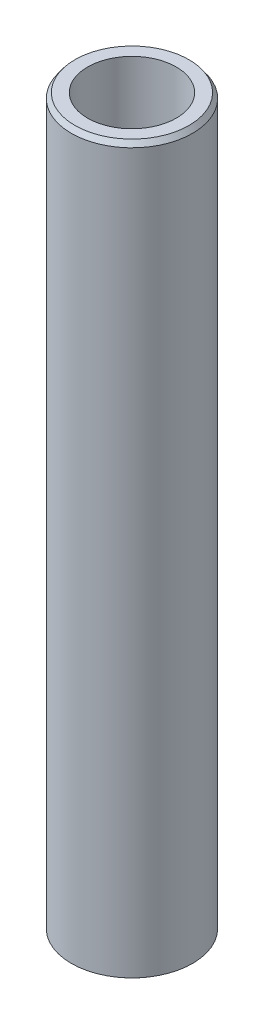
ISO-10303-21;
HEADER;
FILE_DESCRIPTION(('STEP AP214'),'2;1');
FILE_NAME('part.step','',(''),(''),'','','');
FILE_SCHEMA(('AUTOMOTIVE_DESIGN { 1 0 10303 214 1 1 1 1 }'));
ENDSEC;
DATA;
#1=APPLICATION_CONTEXT('core data for automotive mechanical design processes');
#2=APPLICATION_PROTOCOL_DEFINITION('international standard','automotive_design',2000,#1);
#3=PRODUCT_CONTEXT('',#1,'mechanical');
#4=PRODUCT('Part','Part','',(#3));
#5=PRODUCT_RELATED_PRODUCT_CATEGORY('part','',(#4));
#6=PRODUCT_DEFINITION_FORMATION('','',#4);
#7=PRODUCT_DEFINITION_CONTEXT('part definition',#1,'design');
#8=PRODUCT_DEFINITION('design','',#6,#7);
#9=PRODUCT_DEFINITION_SHAPE('','',#8);
#10=(LENGTH_UNIT() NAMED_UNIT(*) SI_UNIT(.MILLI.,.METRE.));
#11=(NAMED_UNIT(*) PLANE_ANGLE_UNIT() SI_UNIT($,.RADIAN.));
#12=(NAMED_UNIT(*) SI_UNIT($,.STERADIAN.) SOLID_ANGLE_UNIT());
#13=UNCERTAINTY_MEASURE_WITH_UNIT(LENGTH_MEASURE(1.E-05),#10,'distance_accuracy_value','');
#14=(GEOMETRIC_REPRESENTATION_CONTEXT(3) GLOBAL_UNCERTAINTY_ASSIGNED_CONTEXT((#13)) GLOBAL_UNIT_ASSIGNED_CONTEXT((#10,
#11,#12)) REPRESENTATION_CONTEXT('',''));
#15=CARTESIAN_POINT('',(0.,0.,0.));
#16=DIRECTION('',(0.,0.,1.));
#17=DIRECTION('',(1.,0.,0.));
#18=AXIS2_PLACEMENT_3D('',#15,#16,#17);
#19=CARTESIAN_POINT('',(0.,600.,0.));
#20=DIRECTION('',(0.,-1.,0.));
#21=DIRECTION('',(0.,0.,-1.));
#22=AXIS2_PLACEMENT_3D('',#19,#20,#21);
#23=CYLINDRICAL_SURFACE('',#22,50.);
#24=CARTESIAN_POINT('',(0.,595.869234670671,0.));
#25=DIRECTION('',(0.,1.,0.));
#26=DIRECTION('',(0.,0.,1.));
#27=AXIS2_PLACEMENT_3D('',#24,#25,#26);
#28=CIRCLE('',#27,50.);
#29=CARTESIAN_POINT('',(0.,595.869234670671,50.));
#30=VERTEX_POINT('',#29);
#31=EDGE_CURVE('E50',#30,#30,#28,.F.);
#32=ORIENTED_EDGE('',*,*,#31,.T.);
#33=EDGE_LOOP('',(#32));
#34=FACE_BOUND('',#33,.T.);
#35=CARTESIAN_POINT('',(0.,2.96426664568905,0.));
#36=DIRECTION('',(0.,1.,0.));
#37=DIRECTION('',(0.,0.,1.));
#38=AXIS2_PLACEMENT_3D('',#35,#36,#37);
#39=CIRCLE('',#38,50.);
#40=CARTESIAN_POINT('',(0.,2.96426664568905,50.));
#41=VERTEX_POINT('',#40);
#42=EDGE_CURVE('E51',#41,#41,#39,.T.);
#43=ORIENTED_EDGE('',*,*,#42,.T.);
#44=EDGE_LOOP('',(#43));
#45=FACE_BOUND('',#44,.T.);
#46=ADVANCED_FACE('F39',(#34,#45),#23,.T.);
#47=CARTESIAN_POINT('',(0.,600.,0.));
#48=DIRECTION('',(0.,1.,0.));
#49=DIRECTION('',(0.,0.,1.));
#50=AXIS2_PLACEMENT_3D('',#47,#48,#49);
#51=PLANE('',#50);
#52=CARTESIAN_POINT('',(0.,600.,0.));
#53=DIRECTION('',(0.,1.,0.));
#54=DIRECTION('',(0.,0.,1.));
#55=AXIS2_PLACEMENT_3D('',#52,#53,#54);
#56=CIRCLE('',#55,47.0357333543107);
#57=CARTESIAN_POINT('',(0.,600.,47.0357333543107));
#58=VERTEX_POINT('',#57);
#59=EDGE_CURVE('E54',#58,#58,#56,.T.);
#60=ORIENTED_EDGE('',*,*,#59,.T.);
#61=EDGE_LOOP('',(#60));
#62=FACE_BOUND('',#61,.T.);
#63=CARTESIAN_POINT('',(0.,600.,0.));
#64=DIRECTION('',(0.,1.,0.));
#65=DIRECTION('',(0.,0.,1.));
#66=AXIS2_PLACEMENT_3D('',#63,#64,#65);
#67=CIRCLE('',#66,36.5903218449195);
#68=CARTESIAN_POINT('',(0.,600.,36.5903218449195));
#69=VERTEX_POINT('',#68);
#70=EDGE_CURVE('E58',#69,#69,#67,.T.);
#71=ORIENTED_EDGE('',*,*,#70,.F.);
#72=EDGE_LOOP('',(#71));
#73=FACE_BOUND('',#72,.T.);
#74=ADVANCED_FACE('F69',(#62,#73),#51,.T.);
#75=CARTESIAN_POINT('',(0.,0.,0.));
#76=DIRECTION('',(0.,1.,0.));
#77=DIRECTION('',(0.,0.,1.));
#78=AXIS2_PLACEMENT_3D('',#75,#76,#77);
#79=PLANE('',#78);
#80=CARTESIAN_POINT('',(0.,0.,0.));
#81=DIRECTION('',(0.,1.,0.));
#82=DIRECTION('',(0.,0.,1.));
#83=AXIS2_PLACEMENT_3D('',#80,#81,#82);
#84=CIRCLE('',#83,45.8692346706718);
#85=CARTESIAN_POINT('',(0.,0.,45.8692346706718));
#86=VERTEX_POINT('',#85);
#87=EDGE_CURVE('E10',#86,#86,#84,.F.);
#88=ORIENTED_EDGE('',*,*,#87,.T.);
#89=EDGE_LOOP('',(#88));
#90=FACE_BOUND('',#89,.T.);
#91=CARTESIAN_POINT('',(0.,0.,0.));
#92=DIRECTION('',(0.,1.,0.));
#93=DIRECTION('',(0.,0.,1.));
#94=AXIS2_PLACEMENT_3D('',#91,#92,#93);
#95=CIRCLE('',#94,36.5903218449195);
#96=CARTESIAN_POINT('',(0.,0.,36.5903218449195));
#97=VERTEX_POINT('',#96);
#98=EDGE_CURVE('E63',#97,#97,#95,.T.);
#99=ORIENTED_EDGE('',*,*,#98,.T.);
#100=EDGE_LOOP('',(#99));
#101=FACE_BOUND('',#100,.T.);
#102=ADVANCED_FACE('F75',(#90,#101),#79,.F.);
#103=CARTESIAN_POINT('',(0.,600.,0.));
#104=DIRECTION('',(0.,-1.,0.));
#105=DIRECTION('',(0.,0.,-1.));
#106=AXIS2_PLACEMENT_3D('',#103,#104,#105);
#107=CYLINDRICAL_SURFACE('',#106,36.5903218449195);
#108=ORIENTED_EDGE('',*,*,#70,.T.);
#109=EDGE_LOOP('',(#108));
#110=FACE_BOUND('',#109,.T.);
#111=ORIENTED_EDGE('',*,*,#98,.F.);
#112=EDGE_LOOP('',(#111));
#113=FACE_BOUND('',#112,.T.);
#114=ADVANCED_FACE('F70',(#110,#113),#107,.F.);
#115=CARTESIAN_POINT('',(0.,600.,0.));
#116=DIRECTION('',(0.,-1.,0.));
#117=DIRECTION('',(0.,0.,-1.));
#118=AXIS2_PLACEMENT_3D('',#115,#116,#117);
#119=CONICAL_SURFACE('',#118,47.0357333543107,0.622445347572902);
#120=ORIENTED_EDGE('',*,*,#31,.F.);
#121=EDGE_LOOP('',(#120));
#122=FACE_BOUND('',#121,.T.);
#123=ORIENTED_EDGE('',*,*,#59,.F.);
#124=EDGE_LOOP('',(#123));
#125=FACE_BOUND('',#124,.T.);
#126=ADVANCED_FACE('F81',(#122,#125),#119,.T.);
#127=CARTESIAN_POINT('',(0.,2.96426664568905,0.));
#128=DIRECTION('',(0.,1.,0.));
#129=DIRECTION('',(0.,0.,1.));
#130=AXIS2_PLACEMENT_3D('',#127,#128,#129);
#131=CONICAL_SURFACE('',#130,50.,0.948350979221996);
#132=ORIENTED_EDGE('',*,*,#87,.F.);
#133=EDGE_LOOP('',(#132));
#134=FACE_BOUND('',#133,.T.);
#135=ORIENTED_EDGE('',*,*,#42,.F.);
#136=EDGE_LOOP('',(#135));
#137=FACE_BOUND('',#136,.T.);
#138=ADVANCED_FACE('F45',(#134,#137),#131,.T.);
#139=CLOSED_SHELL('',(#46,#74,#102,#114,#126,#138));
#140=MANIFOLD_SOLID_BREP('B2',#139);
#141=ADVANCED_BREP_SHAPE_REPRESENTATION('',(#18,#140),#14);
#142=SHAPE_DEFINITION_REPRESENTATION(#9,#141);
ENDSEC;
END-ISO-10303-21;
